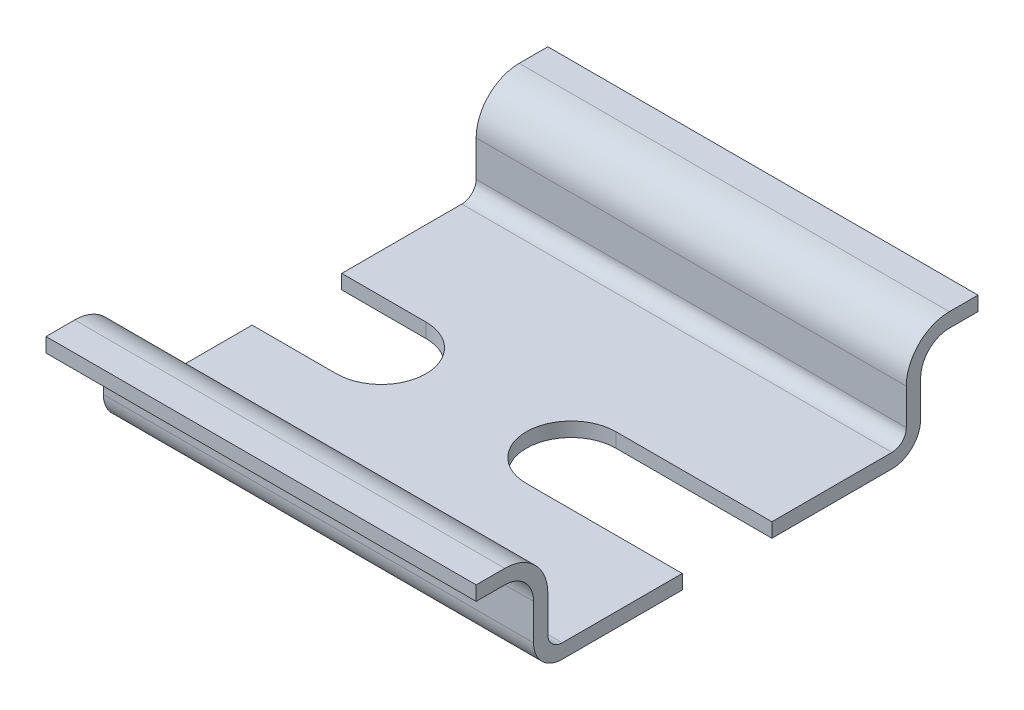
ISO-10303-21;
HEADER;
FILE_DESCRIPTION(('STEP AP214'),'2;1');
FILE_NAME('part.step','',(''),(''),'','','');
FILE_SCHEMA(('AUTOMOTIVE_DESIGN { 1 0 10303 214 1 1 1 1 }'));
ENDSEC;
DATA;
#1=APPLICATION_CONTEXT('core data for automotive mechanical design processes');
#2=APPLICATION_PROTOCOL_DEFINITION('international standard','automotive_design',2000,#1);
#3=PRODUCT_CONTEXT('',#1,'mechanical');
#4=PRODUCT('Part','Part','',(#3));
#5=PRODUCT_RELATED_PRODUCT_CATEGORY('part','',(#4));
#6=PRODUCT_DEFINITION_FORMATION('','',#4);
#7=PRODUCT_DEFINITION_CONTEXT('part definition',#1,'design');
#8=PRODUCT_DEFINITION('design','',#6,#7);
#9=PRODUCT_DEFINITION_SHAPE('','',#8);
#10=(LENGTH_UNIT() NAMED_UNIT(*) SI_UNIT(.MILLI.,.METRE.));
#11=(NAMED_UNIT(*) PLANE_ANGLE_UNIT() SI_UNIT($,.RADIAN.));
#12=(NAMED_UNIT(*) SI_UNIT($,.STERADIAN.) SOLID_ANGLE_UNIT());
#13=UNCERTAINTY_MEASURE_WITH_UNIT(LENGTH_MEASURE(1.E-05),#10,'distance_accuracy_value','');
#14=(GEOMETRIC_REPRESENTATION_CONTEXT(3) GLOBAL_UNCERTAINTY_ASSIGNED_CONTEXT((#13)) GLOBAL_UNIT_ASSIGNED_CONTEXT((#10,
#11,#12)) REPRESENTATION_CONTEXT('',''));
#15=CARTESIAN_POINT('',(0.,0.,0.));
#16=DIRECTION('',(0.,0.,1.));
#17=DIRECTION('',(1.,0.,0.));
#18=AXIS2_PLACEMENT_3D('',#15,#16,#17);
#19=CARTESIAN_POINT('',(30.,4.5,15.5));
#20=DIRECTION('',(1.,0.,0.));
#21=DIRECTION('',(0.,0.,-1.));
#22=AXIS2_PLACEMENT_3D('',#19,#20,#21);
#23=PLANE('',#22);
#24=DIRECTION('',(0.,-1.,0.));
#25=VECTOR('',#24,1.);
#26=CARTESIAN_POINT('',(30.,7.501,-3.125));
#27=LINE('',#26,#25);
#28=CARTESIAN_POINT('',(30.,1.,-3.125));
#29=VERTEX_POINT('',#28);
#30=CARTESIAN_POINT('',(30.,0.,-3.125));
#31=VERTEX_POINT('',#30);
#32=EDGE_CURVE('E233',#29,#31,#27,.T.);
#33=ORIENTED_EDGE('',*,*,#32,.T.);
#34=DIRECTION('',(0.,0.,1.));
#35=VECTOR('',#34,1.);
#36=CARTESIAN_POINT('',(30.,0.,11.5));
#37=LINE('',#36,#35);
#38=CARTESIAN_POINT('',(30.,0.,-11.5));
#39=VERTEX_POINT('',#38);
#40=EDGE_CURVE('E248',#39,#31,#37,.T.);
#41=ORIENTED_EDGE('',*,*,#40,.F.);
#42=CARTESIAN_POINT('',(30.,2.,-11.5));
#43=DIRECTION('',(-1.,0.,0.));
#44=DIRECTION('',(0.,0.,1.));
#45=AXIS2_PLACEMENT_3D('',#42,#43,#44);
#46=CIRCLE('',#45,2.);
#47=CARTESIAN_POINT('',(30.,2.,-13.5));
#48=VERTEX_POINT('',#47);
#49=EDGE_CURVE('E260',#48,#39,#46,.T.);
#50=ORIENTED_EDGE('',*,*,#49,.F.);
#51=DIRECTION('',(0.,-1.,0.));
#52=VECTOR('',#51,1.);
#53=CARTESIAN_POINT('',(30.,2.,-13.5));
#54=LINE('',#53,#52);
#55=CARTESIAN_POINT('',(30.,4.5,-13.5));
#56=VERTEX_POINT('',#55);
#57=EDGE_CURVE('E265',#56,#48,#54,.T.);
#58=ORIENTED_EDGE('',*,*,#57,.F.);
#59=CARTESIAN_POINT('',(30.,4.5,-15.5));
#60=DIRECTION('',(1.,0.,0.));
#61=DIRECTION('',(0.,0.,-1.));
#62=AXIS2_PLACEMENT_3D('',#59,#60,#61);
#63=CIRCLE('',#62,2.);
#64=CARTESIAN_POINT('',(30.,6.5,-15.5));
#65=VERTEX_POINT('',#64);
#66=EDGE_CURVE('E274',#65,#56,#63,.T.);
#67=ORIENTED_EDGE('',*,*,#66,.F.);
#68=DIRECTION('',(0.,0.,1.));
#69=VECTOR('',#68,1.);
#70=CARTESIAN_POINT('',(30.,6.5,-15.5));
#71=LINE('',#70,#69);
#72=CARTESIAN_POINT('',(30.,6.5,-17.5));
#73=VERTEX_POINT('',#72);
#74=EDGE_CURVE('E278',#73,#65,#71,.T.);
#75=ORIENTED_EDGE('',*,*,#74,.F.);
#76=DIRECTION('',(0.,-1.,0.));
#77=VECTOR('',#76,1.);
#78=CARTESIAN_POINT('',(30.,7.5,-17.5));
#79=LINE('',#78,#77);
#80=CARTESIAN_POINT('',(30.,7.5,-17.5));
#81=VERTEX_POINT('',#80);
#82=EDGE_CURVE('E282',#81,#73,#79,.T.);
#83=ORIENTED_EDGE('',*,*,#82,.F.);
#84=DIRECTION('',(0.,0.,-1.));
#85=VECTOR('',#84,1.);
#86=CARTESIAN_POINT('',(30.,7.5,-15.5));
#87=LINE('',#86,#85);
#88=CARTESIAN_POINT('',(30.,7.5,-15.5));
#89=VERTEX_POINT('',#88);
#90=EDGE_CURVE('E286',#81,#89,#87,.F.);
#91=ORIENTED_EDGE('',*,*,#90,.T.);
#92=CARTESIAN_POINT('',(30.,4.5,-15.5));
#93=DIRECTION('',(1.,0.,0.));
#94=DIRECTION('',(0.,0.,-1.));
#95=AXIS2_PLACEMENT_3D('',#92,#93,#94);
#96=CIRCLE('',#95,3.);
#97=CARTESIAN_POINT('',(30.,4.5,-12.5));
#98=VERTEX_POINT('',#97);
#99=EDGE_CURVE('E289',#89,#98,#96,.T.);
#100=ORIENTED_EDGE('',*,*,#99,.T.);
#101=DIRECTION('',(0.,1.,0.));
#102=VECTOR('',#101,1.);
#103=CARTESIAN_POINT('',(30.,2.,-12.5));
#104=LINE('',#103,#102);
#105=CARTESIAN_POINT('',(30.,2.,-12.5));
#106=VERTEX_POINT('',#105);
#107=EDGE_CURVE('E292',#98,#106,#104,.F.);
#108=ORIENTED_EDGE('',*,*,#107,.T.);
#109=CARTESIAN_POINT('',(30.,2.,-11.5));
#110=DIRECTION('',(1.,0.,0.));
#111=DIRECTION('',(0.,0.,-1.));
#112=AXIS2_PLACEMENT_3D('',#109,#110,#111);
#113=CIRCLE('',#112,0.999999999999999);
#114=CARTESIAN_POINT('',(30.,1.,-11.5));
#115=VERTEX_POINT('',#114);
#116=EDGE_CURVE('E295',#106,#115,#113,.F.);
#117=ORIENTED_EDGE('',*,*,#116,.T.);
#118=DIRECTION('',(0.,0.,-1.));
#119=VECTOR('',#118,1.);
#120=CARTESIAN_POINT('',(30.,1.,11.5));
#121=LINE('',#120,#119);
#122=EDGE_CURVE('E251',#115,#29,#121,.F.);
#123=ORIENTED_EDGE('',*,*,#122,.T.);
#124=EDGE_LOOP('',(#33,#41,#50,#58,#67,#75,#83,#91,#100,#108,#117,#123));
#125=FACE_BOUND('',#124,.T.);
#126=ADVANCED_FACE('F45',(#125),#23,.T.);
#127=CARTESIAN_POINT('',(0.,4.5,15.5));
#128=DIRECTION('',(1.,0.,0.));
#129=DIRECTION('',(0.,0.,-1.));
#130=AXIS2_PLACEMENT_3D('',#127,#128,#129);
#131=PLANE('',#130);
#132=DIRECTION('',(0.,0.,1.));
#133=VECTOR('',#132,1.);
#134=CARTESIAN_POINT('',(0.,0.,11.5));
#135=LINE('',#134,#133);
#136=CARTESIAN_POINT('',(0.,0.,-11.5));
#137=VERTEX_POINT('',#136);
#138=CARTESIAN_POINT('',(0.,0.,-3.125));
#139=VERTEX_POINT('',#138);
#140=EDGE_CURVE('E337',#137,#139,#135,.T.);
#141=ORIENTED_EDGE('',*,*,#140,.T.);
#142=DIRECTION('',(0.,-1.,0.));
#143=VECTOR('',#142,1.);
#144=CARTESIAN_POINT('',(0.,7.501,-3.125));
#145=LINE('',#144,#143);
#146=CARTESIAN_POINT('',(0.,1.,-3.125));
#147=VERTEX_POINT('',#146);
#148=EDGE_CURVE('E518',#147,#139,#145,.T.);
#149=ORIENTED_EDGE('',*,*,#148,.F.);
#150=DIRECTION('',(0.,0.,-1.));
#151=VECTOR('',#150,1.);
#152=CARTESIAN_POINT('',(0.,1.,11.5));
#153=LINE('',#152,#151);
#154=CARTESIAN_POINT('',(0.,1.,-11.5));
#155=VERTEX_POINT('',#154);
#156=EDGE_CURVE('E374',#155,#147,#153,.F.);
#157=ORIENTED_EDGE('',*,*,#156,.F.);
#158=CARTESIAN_POINT('',(0.,2.,-11.5));
#159=DIRECTION('',(1.,0.,0.));
#160=DIRECTION('',(0.,0.,-1.));
#161=AXIS2_PLACEMENT_3D('',#158,#159,#160);
#162=CIRCLE('',#161,0.999999999999999);
#163=CARTESIAN_POINT('',(0.,2.,-12.5));
#164=VERTEX_POINT('',#163);
#165=EDGE_CURVE('E370',#164,#155,#162,.F.);
#166=ORIENTED_EDGE('',*,*,#165,.F.);
#167=DIRECTION('',(0.,1.,0.));
#168=VECTOR('',#167,1.);
#169=CARTESIAN_POINT('',(0.,2.,-12.5));
#170=LINE('',#169,#168);
#171=CARTESIAN_POINT('',(0.,4.5,-12.5));
#172=VERTEX_POINT('',#171);
#173=EDGE_CURVE('E367',#172,#164,#170,.F.);
#174=ORIENTED_EDGE('',*,*,#173,.F.);
#175=CARTESIAN_POINT('',(0.,4.5,-15.5));
#176=DIRECTION('',(1.,0.,0.));
#177=DIRECTION('',(0.,0.,-1.));
#178=AXIS2_PLACEMENT_3D('',#175,#176,#177);
#179=CIRCLE('',#178,3.);
#180=CARTESIAN_POINT('',(0.,7.5,-15.5));
#181=VERTEX_POINT('',#180);
#182=EDGE_CURVE('E364',#181,#172,#179,.T.);
#183=ORIENTED_EDGE('',*,*,#182,.F.);
#184=DIRECTION('',(0.,0.,-1.));
#185=VECTOR('',#184,1.);
#186=CARTESIAN_POINT('',(0.,7.5,-15.5));
#187=LINE('',#186,#185);
#188=CARTESIAN_POINT('',(0.,7.5,-17.5));
#189=VERTEX_POINT('',#188);
#190=EDGE_CURVE('E361',#189,#181,#187,.F.);
#191=ORIENTED_EDGE('',*,*,#190,.F.);
#192=DIRECTION('',(0.,-1.,0.));
#193=VECTOR('',#192,1.);
#194=CARTESIAN_POINT('',(0.,7.5,-17.5));
#195=LINE('',#194,#193);
#196=CARTESIAN_POINT('',(0.,6.5,-17.5));
#197=VERTEX_POINT('',#196);
#198=EDGE_CURVE('E357',#189,#197,#195,.T.);
#199=ORIENTED_EDGE('',*,*,#198,.T.);
#200=DIRECTION('',(0.,0.,1.));
#201=VECTOR('',#200,1.);
#202=CARTESIAN_POINT('',(0.,6.5,-15.5));
#203=LINE('',#202,#201);
#204=CARTESIAN_POINT('',(0.,6.5,-15.5));
#205=VERTEX_POINT('',#204);
#206=EDGE_CURVE('E353',#197,#205,#203,.T.);
#207=ORIENTED_EDGE('',*,*,#206,.T.);
#208=CARTESIAN_POINT('',(0.,4.5,-15.5));
#209=DIRECTION('',(1.,0.,0.));
#210=DIRECTION('',(0.,0.,-1.));
#211=AXIS2_PLACEMENT_3D('',#208,#209,#210);
#212=CIRCLE('',#211,2.);
#213=CARTESIAN_POINT('',(0.,4.5,-13.5));
#214=VERTEX_POINT('',#213);
#215=EDGE_CURVE('E349',#205,#214,#212,.T.);
#216=ORIENTED_EDGE('',*,*,#215,.T.);
#217=DIRECTION('',(0.,-1.,0.));
#218=VECTOR('',#217,1.);
#219=CARTESIAN_POINT('',(0.,2.,-13.5));
#220=LINE('',#219,#218);
#221=CARTESIAN_POINT('',(0.,2.,-13.5));
#222=VERTEX_POINT('',#221);
#223=EDGE_CURVE('E345',#214,#222,#220,.T.);
#224=ORIENTED_EDGE('',*,*,#223,.T.);
#225=CARTESIAN_POINT('',(0.,2.,-11.5));
#226=DIRECTION('',(-1.,0.,0.));
#227=DIRECTION('',(0.,0.,1.));
#228=AXIS2_PLACEMENT_3D('',#225,#226,#227);
#229=CIRCLE('',#228,2.);
#230=EDGE_CURVE('E341',#222,#137,#229,.T.);
#231=ORIENTED_EDGE('',*,*,#230,.T.);
#232=EDGE_LOOP('',(#141,#149,#157,#166,#174,#183,#191,#199,#207,#216,#224,#231));
#233=FACE_BOUND('',#232,.T.);
#234=ADVANCED_FACE('F580',(#233),#131,.F.);
#235=CARTESIAN_POINT('',(30.,7.5,15.5));
#236=DIRECTION('',(0.,-1.,0.));
#237=DIRECTION('',(0.,0.,-1.));
#238=AXIS2_PLACEMENT_3D('',#235,#236,#237);
#239=PLANE('',#238);
#240=DIRECTION('',(0.,0.,-1.));
#241=VECTOR('',#240,1.);
#242=CARTESIAN_POINT('',(0.,7.5,15.5));
#243=LINE('',#242,#241);
#244=CARTESIAN_POINT('',(0.,7.5,15.5));
#245=VERTEX_POINT('',#244);
#246=CARTESIAN_POINT('',(0.,7.5,17.5));
#247=VERTEX_POINT('',#246);
#248=EDGE_CURVE('E311',#245,#247,#243,.F.);
#249=ORIENTED_EDGE('',*,*,#248,.T.);
#250=DIRECTION('',(-1.,0.,0.));
#251=VECTOR('',#250,1.);
#252=CARTESIAN_POINT('',(30.,7.5,17.5));
#253=LINE('',#252,#251);
#254=CARTESIAN_POINT('',(30.,7.5,17.5));
#255=VERTEX_POINT('',#254);
#256=EDGE_CURVE('E11',#255,#247,#253,.T.);
#257=ORIENTED_EDGE('',*,*,#256,.F.);
#258=DIRECTION('',(0.,0.,-1.));
#259=VECTOR('',#258,1.);
#260=CARTESIAN_POINT('',(30.,7.5,15.5));
#261=LINE('',#260,#259);
#262=CARTESIAN_POINT('',(30.,7.5,15.5));
#263=VERTEX_POINT('',#262);
#264=EDGE_CURVE('E387',#263,#255,#261,.F.);
#265=ORIENTED_EDGE('',*,*,#264,.F.);
#266=DIRECTION('',(-1.,0.,0.));
#267=VECTOR('',#266,1.);
#268=CARTESIAN_POINT('',(30.,7.5,15.5));
#269=LINE('',#268,#267);
#270=EDGE_CURVE('E310',#263,#245,#269,.T.);
#271=ORIENTED_EDGE('',*,*,#270,.T.);
#272=EDGE_LOOP('',(#249,#257,#265,#271));
#273=FACE_BOUND('',#272,.T.);
#274=ADVANCED_FACE('F47',(#273),#239,.F.);
#275=CARTESIAN_POINT('',(30.,6.5,17.5));
#276=DIRECTION('',(0.,0.,1.));
#277=DIRECTION('',(1.,0.,0.));
#278=AXIS2_PLACEMENT_3D('',#275,#276,#277);
#279=PLANE('',#278);
#280=DIRECTION('',(0.,1.,0.));
#281=VECTOR('',#280,1.);
#282=CARTESIAN_POINT('',(0.,6.5,17.5));
#283=LINE('',#282,#281);
#284=CARTESIAN_POINT('',(0.,6.5,17.5));
#285=VERTEX_POINT('',#284);
#286=EDGE_CURVE('E315',#285,#247,#283,.T.);
#287=ORIENTED_EDGE('',*,*,#286,.F.);
#288=DIRECTION('',(-1.,0.,0.));
#289=VECTOR('',#288,1.);
#290=CARTESIAN_POINT('',(30.,6.5,17.5));
#291=LINE('',#290,#289);
#292=CARTESIAN_POINT('',(30.,6.5,17.5));
#293=VERTEX_POINT('',#292);
#294=EDGE_CURVE('E54',#293,#285,#291,.T.);
#295=ORIENTED_EDGE('',*,*,#294,.F.);
#296=DIRECTION('',(0.,1.,0.));
#297=VECTOR('',#296,1.);
#298=CARTESIAN_POINT('',(30.,6.5,17.5));
#299=LINE('',#298,#297);
#300=EDGE_CURVE('E476',#293,#255,#299,.T.);
#301=ORIENTED_EDGE('',*,*,#300,.T.);
#302=ORIENTED_EDGE('',*,*,#256,.T.);
#303=EDGE_LOOP('',(#287,#295,#301,#302));
#304=FACE_BOUND('',#303,.T.);
#305=ADVANCED_FACE('F459',(#304),#279,.T.);
#306=CARTESIAN_POINT('',(30.,6.5,15.5));
#307=DIRECTION('',(0.,-1.,0.));
#308=DIRECTION('',(0.,0.,-1.));
#309=AXIS2_PLACEMENT_3D('',#306,#307,#308);
#310=PLANE('',#309);
#311=DIRECTION('',(0.,0.,1.));
#312=VECTOR('',#311,1.);
#313=CARTESIAN_POINT('',(0.,6.5,15.5));
#314=LINE('',#313,#312);
#315=CARTESIAN_POINT('',(0.,6.5,15.5));
#316=VERTEX_POINT('',#315);
#317=EDGE_CURVE('E320',#316,#285,#314,.T.);
#318=ORIENTED_EDGE('',*,*,#317,.F.);
#319=DIRECTION('',(-1.,0.,0.));
#320=VECTOR('',#319,1.);
#321=CARTESIAN_POINT('',(30.,6.5,15.5));
#322=LINE('',#321,#320);
#323=CARTESIAN_POINT('',(30.,6.5,15.5));
#324=VERTEX_POINT('',#323);
#325=EDGE_CURVE('E446',#324,#316,#322,.T.);
#326=ORIENTED_EDGE('',*,*,#325,.F.);
#327=DIRECTION('',(0.,0.,1.));
#328=VECTOR('',#327,1.);
#329=CARTESIAN_POINT('',(30.,6.5,15.5));
#330=LINE('',#329,#328);
#331=EDGE_CURVE('E455',#324,#293,#330,.T.);
#332=ORIENTED_EDGE('',*,*,#331,.T.);
#333=ORIENTED_EDGE('',*,*,#294,.T.);
#334=EDGE_LOOP('',(#318,#326,#332,#333));
#335=FACE_BOUND('',#334,.T.);
#336=ADVANCED_FACE('F453',(#335),#310,.T.);
#337=CARTESIAN_POINT('',(30.,4.5,15.5));
#338=DIRECTION('',(-1.,0.,0.));
#339=DIRECTION('',(0.,0.,1.));
#340=AXIS2_PLACEMENT_3D('',#337,#338,#339);
#341=CYLINDRICAL_SURFACE('',#340,2.);
#342=CARTESIAN_POINT('',(0.,4.5,15.5));
#343=DIRECTION('',(1.,0.,0.));
#344=DIRECTION('',(0.,0.,1.));
#345=AXIS2_PLACEMENT_3D('',#342,#343,#344);
#346=CIRCLE('',#345,2.);
#347=CARTESIAN_POINT('',(0.,4.5,13.5));
#348=VERTEX_POINT('',#347);
#349=EDGE_CURVE('E324',#348,#316,#346,.T.);
#350=ORIENTED_EDGE('',*,*,#349,.F.);
#351=DIRECTION('',(-1.,0.,0.));
#352=VECTOR('',#351,1.);
#353=CARTESIAN_POINT('',(30.,4.5,13.5));
#354=LINE('',#353,#352);
#355=CARTESIAN_POINT('',(30.,4.5,13.5));
#356=VERTEX_POINT('',#355);
#357=EDGE_CURVE('E443',#356,#348,#354,.T.);
#358=ORIENTED_EDGE('',*,*,#357,.F.);
#359=CARTESIAN_POINT('',(30.,4.5,15.5));
#360=DIRECTION('',(1.,0.,0.));
#361=DIRECTION('',(0.,0.,1.));
#362=AXIS2_PLACEMENT_3D('',#359,#360,#361);
#363=CIRCLE('',#362,2.);
#364=EDGE_CURVE('E471',#356,#324,#363,.T.);
#365=ORIENTED_EDGE('',*,*,#364,.T.);
#366=ORIENTED_EDGE('',*,*,#325,.T.);
#367=EDGE_LOOP('',(#350,#358,#365,#366));
#368=FACE_BOUND('',#367,.T.);
#369=ADVANCED_FACE('F468',(#368),#341,.F.);
#370=CARTESIAN_POINT('',(30.,2.,13.5));
#371=DIRECTION('',(0.,0.,1.));
#372=DIRECTION('',(1.,0.,0.));
#373=AXIS2_PLACEMENT_3D('',#370,#371,#372);
#374=PLANE('',#373);
#375=DIRECTION('',(0.,1.,0.));
#376=VECTOR('',#375,1.);
#377=CARTESIAN_POINT('',(0.,2.,13.5));
#378=LINE('',#377,#376);
#379=CARTESIAN_POINT('',(0.,2.,13.5));
#380=VERTEX_POINT('',#379);
#381=EDGE_CURVE('E328',#380,#348,#378,.T.);
#382=ORIENTED_EDGE('',*,*,#381,.F.);
#383=DIRECTION('',(-1.,0.,0.));
#384=VECTOR('',#383,1.);
#385=CARTESIAN_POINT('',(30.,2.,13.5));
#386=LINE('',#385,#384);
#387=CARTESIAN_POINT('',(30.,2.,13.5));
#388=VERTEX_POINT('',#387);
#389=EDGE_CURVE('E440',#388,#380,#386,.T.);
#390=ORIENTED_EDGE('',*,*,#389,.F.);
#391=DIRECTION('',(0.,1.,0.));
#392=VECTOR('',#391,1.);
#393=CARTESIAN_POINT('',(30.,2.,13.5));
#394=LINE('',#393,#392);
#395=EDGE_CURVE('E481',#388,#356,#394,.T.);
#396=ORIENTED_EDGE('',*,*,#395,.T.);
#397=ORIENTED_EDGE('',*,*,#357,.T.);
#398=EDGE_LOOP('',(#382,#390,#396,#397));
#399=FACE_BOUND('',#398,.T.);
#400=ADVANCED_FACE('F824',(#399),#374,.T.);
#401=CARTESIAN_POINT('',(30.,2.,11.5));
#402=DIRECTION('',(-1.,0.,0.));
#403=DIRECTION('',(0.,0.,1.));
#404=AXIS2_PLACEMENT_3D('',#401,#402,#403);
#405=CYLINDRICAL_SURFACE('',#404,2.);
#406=CARTESIAN_POINT('',(0.,2.,11.5));
#407=DIRECTION('',(-1.,0.,0.));
#408=DIRECTION('',(0.,0.,-1.));
#409=AXIS2_PLACEMENT_3D('',#406,#407,#408);
#410=CIRCLE('',#409,2.);
#411=CARTESIAN_POINT('',(0.,0.,11.5));
#412=VERTEX_POINT('',#411);
#413=EDGE_CURVE('E332',#412,#380,#410,.T.);
#414=ORIENTED_EDGE('',*,*,#413,.F.);
#415=DIRECTION('',(-1.,0.,0.));
#416=VECTOR('',#415,1.);
#417=CARTESIAN_POINT('',(30.,0.,11.5));
#418=LINE('',#417,#416);
#419=CARTESIAN_POINT('',(30.,0.,11.5));
#420=VERTEX_POINT('',#419);
#421=EDGE_CURVE('E436',#420,#412,#418,.T.);
#422=ORIENTED_EDGE('',*,*,#421,.F.);
#423=CARTESIAN_POINT('',(30.,2.,11.5));
#424=DIRECTION('',(-1.,0.,0.));
#425=DIRECTION('',(0.,0.,-1.));
#426=AXIS2_PLACEMENT_3D('',#423,#424,#425);
#427=CIRCLE('',#426,2.);
#428=EDGE_CURVE('E267',#420,#388,#427,.T.);
#429=ORIENTED_EDGE('',*,*,#428,.T.);
#430=ORIENTED_EDGE('',*,*,#389,.T.);
#431=EDGE_LOOP('',(#414,#422,#429,#430));
#432=FACE_BOUND('',#431,.T.);
#433=ADVANCED_FACE('F493',(#432),#405,.T.);
#434=CARTESIAN_POINT('',(30.,0.,11.5));
#435=DIRECTION('',(0.,-1.,0.));
#436=DIRECTION('',(0.,0.,-1.));
#437=AXIS2_PLACEMENT_3D('',#434,#435,#436);
#438=PLANE('',#437);
#439=DIRECTION('',(1.,0.,0.));
#440=VECTOR('',#439,1.);
#441=CARTESIAN_POINT('',(19.125,0.,-3.125));
#442=LINE('',#441,#440);
#443=CARTESIAN_POINT('',(19.125,0.,-3.125));
#444=VERTEX_POINT('',#443);
#445=EDGE_CURVE('E229',#444,#31,#442,.T.);
#446=ORIENTED_EDGE('',*,*,#445,.F.);
#447=CARTESIAN_POINT('',(19.125,0.,0.));
#448=DIRECTION('',(0.,-1.,0.));
#449=DIRECTION('',(0.,0.,-1.));
#450=AXIS2_PLACEMENT_3D('',#447,#448,#449);
#451=CIRCLE('',#450,3.125);
#452=CARTESIAN_POINT('',(19.125,0.,3.125));
#453=VERTEX_POINT('',#452);
#454=EDGE_CURVE('E242',#453,#444,#451,.T.);
#455=ORIENTED_EDGE('',*,*,#454,.F.);
#456=DIRECTION('',(-1.,0.,0.));
#457=VECTOR('',#456,1.);
#458=CARTESIAN_POINT('',(19.125,0.,3.125));
#459=LINE('',#458,#457);
#460=CARTESIAN_POINT('',(30.,0.,3.125));
#461=VERTEX_POINT('',#460);
#462=EDGE_CURVE('E499',#461,#453,#459,.T.);
#463=ORIENTED_EDGE('',*,*,#462,.F.);
#464=EDGE_CURVE('E261',#461,#420,#37,.T.);
#465=ORIENTED_EDGE('',*,*,#464,.T.);
#466=ORIENTED_EDGE('',*,*,#421,.T.);
#467=CARTESIAN_POINT('',(0.,0.,3.125));
#468=VERTEX_POINT('',#467);
#469=EDGE_CURVE('E336',#468,#412,#135,.T.);
#470=ORIENTED_EDGE('',*,*,#469,.F.);
#471=DIRECTION('',(-1.,0.,0.));
#472=VECTOR('',#471,1.);
#473=CARTESIAN_POINT('',(-5.875,0.,3.125));
#474=LINE('',#473,#472);
#475=CARTESIAN_POINT('',(5.875,0.,3.125));
#476=VERTEX_POINT('',#475);
#477=EDGE_CURVE('E69',#476,#468,#474,.T.);
#478=ORIENTED_EDGE('',*,*,#477,.F.);
#479=CARTESIAN_POINT('',(5.875,0.,0.));
#480=DIRECTION('',(0.,-1.,0.));
#481=DIRECTION('',(0.,0.,1.));
#482=AXIS2_PLACEMENT_3D('',#479,#480,#481);
#483=CIRCLE('',#482,3.125);
#484=CARTESIAN_POINT('',(5.875,0.,-3.125));
#485=VERTEX_POINT('',#484);
#486=EDGE_CURVE('E527',#485,#476,#483,.T.);
#487=ORIENTED_EDGE('',*,*,#486,.F.);
#488=DIRECTION('',(1.,0.,0.));
#489=VECTOR('',#488,1.);
#490=CARTESIAN_POINT('',(-5.875,0.,-3.125));
#491=LINE('',#490,#489);
#492=EDGE_CURVE('E533',#139,#485,#491,.T.);
#493=ORIENTED_EDGE('',*,*,#492,.F.);
#494=ORIENTED_EDGE('',*,*,#140,.F.);
#495=DIRECTION('',(-1.,0.,0.));
#496=VECTOR('',#495,1.);
#497=CARTESIAN_POINT('',(30.,0.,-11.5));
#498=LINE('',#497,#496);
#499=EDGE_CURVE('E258',#39,#137,#498,.T.);
#500=ORIENTED_EDGE('',*,*,#499,.F.);
#501=ORIENTED_EDGE('',*,*,#40,.T.);
#502=EDGE_LOOP('',(#446,#455,#463,#465,#466,#470,#478,#487,#493,#494,#500,#501));
#503=FACE_BOUND('',#502,.T.);
#504=ADVANCED_FACE('F256',(#503),#438,.T.);
#505=CARTESIAN_POINT('',(30.,2.,-11.5));
#506=DIRECTION('',(-1.,0.,0.));
#507=DIRECTION('',(0.,0.,1.));
#508=AXIS2_PLACEMENT_3D('',#505,#506,#507);
#509=CYLINDRICAL_SURFACE('',#508,2.);
#510=ORIENTED_EDGE('',*,*,#230,.F.);
#511=DIRECTION('',(-1.,0.,0.));
#512=VECTOR('',#511,1.);
#513=CARTESIAN_POINT('',(30.,2.,-13.5));
#514=LINE('',#513,#512);
#515=EDGE_CURVE('E431',#48,#222,#514,.T.);
#516=ORIENTED_EDGE('',*,*,#515,.F.);
#517=ORIENTED_EDGE('',*,*,#49,.T.);
#518=ORIENTED_EDGE('',*,*,#499,.T.);
#519=EDGE_LOOP('',(#510,#516,#517,#518));
#520=FACE_BOUND('',#519,.T.);
#521=ADVANCED_FACE('F621',(#520),#509,.T.);
#522=CARTESIAN_POINT('',(30.,2.,-13.5));
#523=DIRECTION('',(0.,0.,-1.));
#524=DIRECTION('',(-1.,0.,0.));
#525=AXIS2_PLACEMENT_3D('',#522,#523,#524);
#526=PLANE('',#525);
#527=ORIENTED_EDGE('',*,*,#223,.F.);
#528=DIRECTION('',(-1.,0.,0.));
#529=VECTOR('',#528,1.);
#530=CARTESIAN_POINT('',(30.,4.5,-13.5));
#531=LINE('',#530,#529);
#532=EDGE_CURVE('E428',#56,#214,#531,.T.);
#533=ORIENTED_EDGE('',*,*,#532,.F.);
#534=ORIENTED_EDGE('',*,*,#57,.T.);
#535=ORIENTED_EDGE('',*,*,#515,.T.);
#536=EDGE_LOOP('',(#527,#533,#534,#535));
#537=FACE_BOUND('',#536,.T.);
#538=ADVANCED_FACE('F618',(#537),#526,.T.);
#539=CARTESIAN_POINT('',(30.,4.5,-15.5));
#540=DIRECTION('',(-1.,0.,0.));
#541=DIRECTION('',(0.,0.,1.));
#542=AXIS2_PLACEMENT_3D('',#539,#540,#541);
#543=CYLINDRICAL_SURFACE('',#542,2.);
#544=ORIENTED_EDGE('',*,*,#215,.F.);
#545=DIRECTION('',(-1.,0.,0.));
#546=VECTOR('',#545,1.);
#547=CARTESIAN_POINT('',(30.,6.5,-15.5));
#548=LINE('',#547,#546);
#549=EDGE_CURVE('E425',#65,#205,#548,.T.);
#550=ORIENTED_EDGE('',*,*,#549,.F.);
#551=ORIENTED_EDGE('',*,*,#66,.T.);
#552=ORIENTED_EDGE('',*,*,#532,.T.);
#553=EDGE_LOOP('',(#544,#550,#551,#552));
#554=FACE_BOUND('',#553,.T.);
#555=ADVANCED_FACE('F614',(#554),#543,.F.);
#556=CARTESIAN_POINT('',(30.,6.5,-15.5));
#557=DIRECTION('',(0.,-1.,0.));
#558=DIRECTION('',(0.,0.,-1.));
#559=AXIS2_PLACEMENT_3D('',#556,#557,#558);
#560=PLANE('',#559);
#561=ORIENTED_EDGE('',*,*,#206,.F.);
#562=DIRECTION('',(-1.,0.,0.));
#563=VECTOR('',#562,1.);
#564=CARTESIAN_POINT('',(30.,6.5,-17.5));
#565=LINE('',#564,#563);
#566=EDGE_CURVE('E422',#73,#197,#565,.T.);
#567=ORIENTED_EDGE('',*,*,#566,.F.);
#568=ORIENTED_EDGE('',*,*,#74,.T.);
#569=ORIENTED_EDGE('',*,*,#549,.T.);
#570=EDGE_LOOP('',(#561,#567,#568,#569));
#571=FACE_BOUND('',#570,.T.);
#572=ADVANCED_FACE('F610',(#571),#560,.T.);
#573=CARTESIAN_POINT('',(30.,7.5,-17.5));
#574=DIRECTION('',(0.,0.,-1.));
#575=DIRECTION('',(-1.,0.,0.));
#576=AXIS2_PLACEMENT_3D('',#573,#574,#575);
#577=PLANE('',#576);
#578=ORIENTED_EDGE('',*,*,#198,.F.);
#579=DIRECTION('',(-1.,0.,0.));
#580=VECTOR('',#579,1.);
#581=CARTESIAN_POINT('',(30.,7.5,-17.5));
#582=LINE('',#581,#580);
#583=EDGE_CURVE('E419',#81,#189,#582,.T.);
#584=ORIENTED_EDGE('',*,*,#583,.F.);
#585=ORIENTED_EDGE('',*,*,#82,.T.);
#586=ORIENTED_EDGE('',*,*,#566,.T.);
#587=EDGE_LOOP('',(#578,#584,#585,#586));
#588=FACE_BOUND('',#587,.T.);
#589=ADVANCED_FACE('F606',(#588),#577,.T.);
#590=CARTESIAN_POINT('',(30.,7.5,-15.5));
#591=DIRECTION('',(0.,-1.,0.));
#592=DIRECTION('',(0.,0.,-1.));
#593=AXIS2_PLACEMENT_3D('',#590,#591,#592);
#594=PLANE('',#593);
#595=ORIENTED_EDGE('',*,*,#190,.T.);
#596=DIRECTION('',(-1.,0.,0.));
#597=VECTOR('',#596,1.);
#598=CARTESIAN_POINT('',(30.,7.5,-15.5));
#599=LINE('',#598,#597);
#600=EDGE_CURVE('E415',#89,#181,#599,.T.);
#601=ORIENTED_EDGE('',*,*,#600,.F.);
#602=ORIENTED_EDGE('',*,*,#90,.F.);
#603=ORIENTED_EDGE('',*,*,#583,.T.);
#604=EDGE_LOOP('',(#595,#601,#602,#603));
#605=FACE_BOUND('',#604,.T.);
#606=ADVANCED_FACE('F602',(#605),#594,.F.);
#607=CARTESIAN_POINT('',(30.,4.5,-15.5));
#608=DIRECTION('',(-1.,0.,0.));
#609=DIRECTION('',(0.,0.,1.));
#610=AXIS2_PLACEMENT_3D('',#607,#608,#609);
#611=CYLINDRICAL_SURFACE('',#610,3.);
#612=ORIENTED_EDGE('',*,*,#182,.T.);
#613=DIRECTION('',(-1.,0.,0.));
#614=VECTOR('',#613,1.);
#615=CARTESIAN_POINT('',(30.,4.5,-12.5));
#616=LINE('',#615,#614);
#617=EDGE_CURVE('E411',#98,#172,#616,.T.);
#618=ORIENTED_EDGE('',*,*,#617,.F.);
#619=ORIENTED_EDGE('',*,*,#99,.F.);
#620=ORIENTED_EDGE('',*,*,#600,.T.);
#621=EDGE_LOOP('',(#612,#618,#619,#620));
#622=FACE_BOUND('',#621,.T.);
#623=ADVANCED_FACE('F598',(#622),#611,.T.);
#624=CARTESIAN_POINT('',(30.,2.,-12.5));
#625=DIRECTION('',(0.,0.,-1.));
#626=DIRECTION('',(-1.,0.,0.));
#627=AXIS2_PLACEMENT_3D('',#624,#625,#626);
#628=PLANE('',#627);
#629=ORIENTED_EDGE('',*,*,#173,.T.);
#630=DIRECTION('',(-1.,0.,0.));
#631=VECTOR('',#630,1.);
#632=CARTESIAN_POINT('',(30.,2.,-12.5));
#633=LINE('',#632,#631);
#634=EDGE_CURVE('E407',#106,#164,#633,.T.);
#635=ORIENTED_EDGE('',*,*,#634,.F.);
#636=ORIENTED_EDGE('',*,*,#107,.F.);
#637=ORIENTED_EDGE('',*,*,#617,.T.);
#638=EDGE_LOOP('',(#629,#635,#636,#637));
#639=FACE_BOUND('',#638,.T.);
#640=ADVANCED_FACE('F593',(#639),#628,.F.);
#641=CARTESIAN_POINT('',(30.,2.,-11.5));
#642=DIRECTION('',(-1.,0.,0.));
#643=DIRECTION('',(0.,0.,1.));
#644=AXIS2_PLACEMENT_3D('',#641,#642,#643);
#645=CYLINDRICAL_SURFACE('',#644,0.999999999999999);
#646=ORIENTED_EDGE('',*,*,#165,.T.);
#647=DIRECTION('',(-1.,0.,0.));
#648=VECTOR('',#647,1.);
#649=CARTESIAN_POINT('',(30.,1.,-11.5));
#650=LINE('',#649,#648);
#651=EDGE_CURVE('E403',#115,#155,#650,.T.);
#652=ORIENTED_EDGE('',*,*,#651,.F.);
#653=ORIENTED_EDGE('',*,*,#116,.F.);
#654=ORIENTED_EDGE('',*,*,#634,.T.);
#655=EDGE_LOOP('',(#646,#652,#653,#654));
#656=FACE_BOUND('',#655,.T.);
#657=ADVANCED_FACE('F587',(#656),#645,.F.);
#658=CARTESIAN_POINT('',(30.,1.,11.5));
#659=DIRECTION('',(0.,-1.,0.));
#660=DIRECTION('',(0.,0.,-1.));
#661=AXIS2_PLACEMENT_3D('',#658,#659,#660);
#662=PLANE('',#661);
#663=CARTESIAN_POINT('',(19.125,0.999999999999999,0.));
#664=DIRECTION('',(0.,-1.,0.));
#665=DIRECTION('',(0.,0.,-1.));
#666=AXIS2_PLACEMENT_3D('',#663,#664,#665);
#667=CIRCLE('',#666,3.125);
#668=CARTESIAN_POINT('',(19.125,0.999999999999999,-3.125));
#669=VERTEX_POINT('',#668);
#670=CARTESIAN_POINT('',(19.125,0.999999999999999,3.125));
#671=VERTEX_POINT('',#670);
#672=EDGE_CURVE('E253',#669,#671,#667,.F.);
#673=ORIENTED_EDGE('',*,*,#672,.F.);
#674=DIRECTION('',(-1.,0.,0.));
#675=VECTOR('',#674,1.);
#676=CARTESIAN_POINT('',(19.125,0.999999999999999,-3.125));
#677=LINE('',#676,#675);
#678=EDGE_CURVE('E501',#29,#669,#677,.T.);
#679=ORIENTED_EDGE('',*,*,#678,.F.);
#680=ORIENTED_EDGE('',*,*,#122,.F.);
#681=ORIENTED_EDGE('',*,*,#651,.T.);
#682=ORIENTED_EDGE('',*,*,#156,.T.);
#683=DIRECTION('',(-1.,0.,0.));
#684=VECTOR('',#683,1.);
#685=CARTESIAN_POINT('',(-5.875,0.999999999999999,-3.125));
#686=LINE('',#685,#684);
#687=CARTESIAN_POINT('',(5.875,0.999999999999999,-3.125));
#688=VERTEX_POINT('',#687);
#689=EDGE_CURVE('E524',#688,#147,#686,.T.);
#690=ORIENTED_EDGE('',*,*,#689,.F.);
#691=CARTESIAN_POINT('',(5.875,0.999999999999999,0.));
#692=DIRECTION('',(0.,-1.,0.));
#693=DIRECTION('',(0.,0.,-1.));
#694=AXIS2_PLACEMENT_3D('',#691,#692,#693);
#695=CIRCLE('',#694,3.125);
#696=CARTESIAN_POINT('',(5.875,0.999999999999999,3.125));
#697=VERTEX_POINT('',#696);
#698=EDGE_CURVE('E521',#697,#688,#695,.F.);
#699=ORIENTED_EDGE('',*,*,#698,.F.);
#700=DIRECTION('',(1.,0.,0.));
#701=VECTOR('',#700,1.);
#702=CARTESIAN_POINT('',(-5.875,0.999999999999999,3.125));
#703=LINE('',#702,#701);
#704=CARTESIAN_POINT('',(0.,1.,3.125));
#705=VERTEX_POINT('',#704);
#706=EDGE_CURVE('E316',#705,#697,#703,.T.);
#707=ORIENTED_EDGE('',*,*,#706,.F.);
#708=CARTESIAN_POINT('',(0.,1.,11.5));
#709=VERTEX_POINT('',#708);
#710=EDGE_CURVE('E373',#705,#709,#153,.F.);
#711=ORIENTED_EDGE('',*,*,#710,.T.);
#712=DIRECTION('',(-1.,0.,0.));
#713=VECTOR('',#712,1.);
#714=CARTESIAN_POINT('',(30.,1.,11.5));
#715=LINE('',#714,#713);
#716=CARTESIAN_POINT('',(30.,1.,11.5));
#717=VERTEX_POINT('',#716);
#718=EDGE_CURVE('E399',#717,#709,#715,.T.);
#719=ORIENTED_EDGE('',*,*,#718,.F.);
#720=CARTESIAN_POINT('',(30.,1.,3.125));
#721=VERTEX_POINT('',#720);
#722=EDGE_CURVE('E298',#721,#717,#121,.F.);
#723=ORIENTED_EDGE('',*,*,#722,.F.);
#724=DIRECTION('',(1.,0.,0.));
#725=VECTOR('',#724,1.);
#726=CARTESIAN_POINT('',(19.125,0.999999999999999,3.125));
#727=LINE('',#726,#725);
#728=EDGE_CURVE('E61',#671,#721,#727,.T.);
#729=ORIENTED_EDGE('',*,*,#728,.F.);
#730=EDGE_LOOP('',(#673,#679,#680,#681,#682,#690,#699,#707,#711,#719,#723,#729));
#731=FACE_BOUND('',#730,.T.);
#732=ADVANCED_FACE('F583',(#731),#662,.F.);
#733=CARTESIAN_POINT('',(30.,2.,11.5));
#734=DIRECTION('',(-1.,0.,0.));
#735=DIRECTION('',(0.,0.,1.));
#736=AXIS2_PLACEMENT_3D('',#733,#734,#735);
#737=CYLINDRICAL_SURFACE('',#736,0.999999999999999);
#738=CARTESIAN_POINT('',(0.,2.,11.5));
#739=DIRECTION('',(1.,0.,0.));
#740=DIRECTION('',(0.,0.,-1.));
#741=AXIS2_PLACEMENT_3D('',#738,#739,#740);
#742=CIRCLE('',#741,0.999999999999999);
#743=CARTESIAN_POINT('',(0.,2.,12.5));
#744=VERTEX_POINT('',#743);
#745=EDGE_CURVE('E378',#709,#744,#742,.F.);
#746=ORIENTED_EDGE('',*,*,#745,.T.);
#747=DIRECTION('',(-1.,0.,0.));
#748=VECTOR('',#747,1.);
#749=CARTESIAN_POINT('',(30.,2.,12.5));
#750=LINE('',#749,#748);
#751=CARTESIAN_POINT('',(30.,2.,12.5));
#752=VERTEX_POINT('',#751);
#753=EDGE_CURVE('E395',#752,#744,#750,.T.);
#754=ORIENTED_EDGE('',*,*,#753,.F.);
#755=CARTESIAN_POINT('',(30.,2.,11.5));
#756=DIRECTION('',(1.,0.,0.));
#757=DIRECTION('',(0.,0.,-1.));
#758=AXIS2_PLACEMENT_3D('',#755,#756,#757);
#759=CIRCLE('',#758,0.999999999999999);
#760=EDGE_CURVE('E301',#717,#752,#759,.F.);
#761=ORIENTED_EDGE('',*,*,#760,.F.);
#762=ORIENTED_EDGE('',*,*,#718,.T.);
#763=EDGE_LOOP('',(#746,#754,#761,#762));
#764=FACE_BOUND('',#763,.T.);
#765=ADVANCED_FACE('F561',(#764),#737,.F.);
#766=CARTESIAN_POINT('',(30.,2.,12.5));
#767=DIRECTION('',(0.,0.,1.));
#768=DIRECTION('',(1.,0.,0.));
#769=AXIS2_PLACEMENT_3D('',#766,#767,#768);
#770=PLANE('',#769);
#771=DIRECTION('',(0.,1.,0.));
#772=VECTOR('',#771,1.);
#773=CARTESIAN_POINT('',(0.,2.,12.5));
#774=LINE('',#773,#772);
#775=CARTESIAN_POINT('',(0.,4.5,12.5));
#776=VERTEX_POINT('',#775);
#777=EDGE_CURVE('E381',#744,#776,#774,.T.);
#778=ORIENTED_EDGE('',*,*,#777,.T.);
#779=DIRECTION('',(-1.,0.,0.));
#780=VECTOR('',#779,1.);
#781=CARTESIAN_POINT('',(30.,4.5,12.5));
#782=LINE('',#781,#780);
#783=CARTESIAN_POINT('',(30.,4.5,12.5));
#784=VERTEX_POINT('',#783);
#785=EDGE_CURVE('E391',#784,#776,#782,.T.);
#786=ORIENTED_EDGE('',*,*,#785,.F.);
#787=DIRECTION('',(0.,1.,0.));
#788=VECTOR('',#787,1.);
#789=CARTESIAN_POINT('',(30.,2.,12.5));
#790=LINE('',#789,#788);
#791=EDGE_CURVE('E304',#752,#784,#790,.T.);
#792=ORIENTED_EDGE('',*,*,#791,.F.);
#793=ORIENTED_EDGE('',*,*,#753,.T.);
#794=EDGE_LOOP('',(#778,#786,#792,#793));
#795=FACE_BOUND('',#794,.T.);
#796=ADVANCED_FACE('F557',(#795),#770,.F.);
#797=CARTESIAN_POINT('',(30.,4.5,15.5));
#798=DIRECTION('',(-1.,0.,0.));
#799=DIRECTION('',(0.,0.,1.));
#800=AXIS2_PLACEMENT_3D('',#797,#798,#799);
#801=CYLINDRICAL_SURFACE('',#800,3.);
#802=CARTESIAN_POINT('',(0.,4.5,15.5));
#803=DIRECTION('',(1.,0.,0.));
#804=DIRECTION('',(0.,0.,-1.));
#805=AXIS2_PLACEMENT_3D('',#802,#803,#804);
#806=CIRCLE('',#805,3.);
#807=EDGE_CURVE('E384',#776,#245,#806,.T.);
#808=ORIENTED_EDGE('',*,*,#807,.T.);
#809=ORIENTED_EDGE('',*,*,#270,.F.);
#810=CARTESIAN_POINT('',(30.,4.5,15.5));
#811=DIRECTION('',(1.,0.,0.));
#812=DIRECTION('',(0.,0.,-1.));
#813=AXIS2_PLACEMENT_3D('',#810,#811,#812);
#814=CIRCLE('',#813,3.);
#815=EDGE_CURVE('E307',#784,#263,#814,.T.);
#816=ORIENTED_EDGE('',*,*,#815,.F.);
#817=ORIENTED_EDGE('',*,*,#785,.T.);
#818=EDGE_LOOP('',(#808,#809,#816,#817));
#819=FACE_BOUND('',#818,.T.);
#820=ADVANCED_FACE('F553',(#819),#801,.T.);
#821=DIRECTION('',(0.,1.,0.));
#822=VECTOR('',#821,1.);
#823=CARTESIAN_POINT('',(30.,7.501,3.125));
#824=LINE('',#823,#822);
#825=EDGE_CURVE('E254',#461,#721,#824,.T.);
#826=ORIENTED_EDGE('',*,*,#825,.T.);
#827=ORIENTED_EDGE('',*,*,#722,.T.);
#828=ORIENTED_EDGE('',*,*,#760,.T.);
#829=ORIENTED_EDGE('',*,*,#791,.T.);
#830=ORIENTED_EDGE('',*,*,#815,.T.);
#831=ORIENTED_EDGE('',*,*,#264,.T.);
#832=ORIENTED_EDGE('',*,*,#300,.F.);
#833=ORIENTED_EDGE('',*,*,#331,.F.);
#834=ORIENTED_EDGE('',*,*,#364,.F.);
#835=ORIENTED_EDGE('',*,*,#395,.F.);
#836=ORIENTED_EDGE('',*,*,#428,.F.);
#837=ORIENTED_EDGE('',*,*,#464,.F.);
#838=EDGE_LOOP('',(#826,#827,#828,#829,#830,#831,#832,#833,#834,#835,#836,#837));
#839=FACE_BOUND('',#838,.T.);
#840=ADVANCED_FACE('F473',(#839),#23,.T.);
#841=ORIENTED_EDGE('',*,*,#710,.F.);
#842=DIRECTION('',(0.,1.,0.));
#843=VECTOR('',#842,1.);
#844=CARTESIAN_POINT('',(0.,7.501,3.125));
#845=LINE('',#844,#843);
#846=EDGE_CURVE('E515',#468,#705,#845,.T.);
#847=ORIENTED_EDGE('',*,*,#846,.F.);
#848=ORIENTED_EDGE('',*,*,#469,.T.);
#849=ORIENTED_EDGE('',*,*,#413,.T.);
#850=ORIENTED_EDGE('',*,*,#381,.T.);
#851=ORIENTED_EDGE('',*,*,#349,.T.);
#852=ORIENTED_EDGE('',*,*,#317,.T.);
#853=ORIENTED_EDGE('',*,*,#286,.T.);
#854=ORIENTED_EDGE('',*,*,#248,.F.);
#855=ORIENTED_EDGE('',*,*,#807,.F.);
#856=ORIENTED_EDGE('',*,*,#777,.F.);
#857=ORIENTED_EDGE('',*,*,#745,.F.);
#858=EDGE_LOOP('',(#841,#847,#848,#849,#850,#851,#852,#853,#854,#855,#856,#857));
#859=FACE_BOUND('',#858,.T.);
#860=ADVANCED_FACE('F464',(#859),#131,.F.);
#861=CARTESIAN_POINT('',(5.875,7.501,0.));
#862=DIRECTION('',(0.,-1.,0.));
#863=DIRECTION('',(0.,0.,-1.));
#864=AXIS2_PLACEMENT_3D('',#861,#862,#863);
#865=CYLINDRICAL_SURFACE('',#864,3.125);
#866=ORIENTED_EDGE('',*,*,#698,.T.);
#867=DIRECTION('',(0.,-1.,0.));
#868=VECTOR('',#867,1.);
#869=CARTESIAN_POINT('',(5.875,7.501,-3.125));
#870=LINE('',#869,#868);
#871=EDGE_CURVE('E538',#688,#485,#870,.T.);
#872=ORIENTED_EDGE('',*,*,#871,.T.);
#873=ORIENTED_EDGE('',*,*,#486,.T.);
#874=DIRECTION('',(0.,-1.,0.));
#875=VECTOR('',#874,1.);
#876=CARTESIAN_POINT('',(5.875,7.501,3.125));
#877=LINE('',#876,#875);
#878=EDGE_CURVE('E537',#697,#476,#877,.T.);
#879=ORIENTED_EDGE('',*,*,#878,.F.);
#880=EDGE_LOOP('',(#866,#872,#873,#879));
#881=FACE_BOUND('',#880,.T.);
#882=ADVANCED_FACE('F571',(#881),#865,.F.);
#883=CARTESIAN_POINT('',(-5.875,7.501,-3.125));
#884=DIRECTION('',(0.,0.,-1.));
#885=DIRECTION('',(-1.,0.,0.));
#886=AXIS2_PLACEMENT_3D('',#883,#884,#885);
#887=PLANE('',#886);
#888=ORIENTED_EDGE('',*,*,#689,.T.);
#889=ORIENTED_EDGE('',*,*,#148,.T.);
#890=ORIENTED_EDGE('',*,*,#492,.T.);
#891=ORIENTED_EDGE('',*,*,#871,.F.);
#892=EDGE_LOOP('',(#888,#889,#890,#891));
#893=FACE_BOUND('',#892,.T.);
#894=ADVANCED_FACE('F576',(#893),#887,.F.);
#895=CARTESIAN_POINT('',(-5.875,7.501,3.125));
#896=DIRECTION('',(0.,0.,1.));
#897=DIRECTION('',(1.,0.,0.));
#898=AXIS2_PLACEMENT_3D('',#895,#896,#897);
#899=PLANE('',#898);
#900=ORIENTED_EDGE('',*,*,#706,.T.);
#901=ORIENTED_EDGE('',*,*,#878,.T.);
#902=ORIENTED_EDGE('',*,*,#477,.T.);
#903=ORIENTED_EDGE('',*,*,#846,.T.);
#904=EDGE_LOOP('',(#900,#901,#902,#903));
#905=FACE_BOUND('',#904,.T.);
#906=ADVANCED_FACE('F749',(#905),#899,.F.);
#907=CARTESIAN_POINT('',(19.125,7.501,-3.125));
#908=DIRECTION('',(0.,0.,-1.));
#909=DIRECTION('',(-1.,0.,0.));
#910=AXIS2_PLACEMENT_3D('',#907,#908,#909);
#911=PLANE('',#910);
#912=ORIENTED_EDGE('',*,*,#678,.T.);
#913=DIRECTION('',(0.,-1.,0.));
#914=VECTOR('',#913,1.);
#915=CARTESIAN_POINT('',(19.125,7.501,-3.125));
#916=LINE('',#915,#914);
#917=EDGE_CURVE('E235',#669,#444,#916,.T.);
#918=ORIENTED_EDGE('',*,*,#917,.T.);
#919=ORIENTED_EDGE('',*,*,#445,.T.);
#920=ORIENTED_EDGE('',*,*,#32,.F.);
#921=EDGE_LOOP('',(#912,#918,#919,#920));
#922=FACE_BOUND('',#921,.T.);
#923=ADVANCED_FACE('F232',(#922),#911,.F.);
#924=CARTESIAN_POINT('',(19.125,7.501,0.));
#925=DIRECTION('',(0.,-1.,0.));
#926=DIRECTION('',(0.,0.,-1.));
#927=AXIS2_PLACEMENT_3D('',#924,#925,#926);
#928=CYLINDRICAL_SURFACE('',#927,3.125);
#929=ORIENTED_EDGE('',*,*,#672,.T.);
#930=DIRECTION('',(0.,-1.,0.));
#931=VECTOR('',#930,1.);
#932=CARTESIAN_POINT('',(19.125,7.501,3.125));
#933=LINE('',#932,#931);
#934=EDGE_CURVE('E241',#671,#453,#933,.T.);
#935=ORIENTED_EDGE('',*,*,#934,.T.);
#936=ORIENTED_EDGE('',*,*,#454,.T.);
#937=ORIENTED_EDGE('',*,*,#917,.F.);
#938=EDGE_LOOP('',(#929,#935,#936,#937));
#939=FACE_BOUND('',#938,.T.);
#940=ADVANCED_FACE('F768',(#939),#928,.F.);
#941=CARTESIAN_POINT('',(19.125,7.501,3.125));
#942=DIRECTION('',(0.,0.,1.));
#943=DIRECTION('',(1.,0.,0.));
#944=AXIS2_PLACEMENT_3D('',#941,#942,#943);
#945=PLANE('',#944);
#946=ORIENTED_EDGE('',*,*,#728,.T.);
#947=ORIENTED_EDGE('',*,*,#825,.F.);
#948=ORIENTED_EDGE('',*,*,#462,.T.);
#949=ORIENTED_EDGE('',*,*,#934,.F.);
#950=EDGE_LOOP('',(#946,#947,#948,#949));
#951=FACE_BOUND('',#950,.T.);
#952=ADVANCED_FACE('F777',(#951),#945,.F.);
#953=CLOSED_SHELL('',(#126,#234,#274,#305,#336,#369,#400,#433,#504,#521,#538,#555,#572,#589,
#606,#623,#640,#657,#732,#765,#796,#820,#840,#860,#882,#894,#906,#923,#940,#952));
#954=MANIFOLD_SOLID_BREP('B2',#953);
#955=ADVANCED_BREP_SHAPE_REPRESENTATION('',(#18,#954),#14);
#956=SHAPE_DEFINITION_REPRESENTATION(#9,#955);
ENDSEC;
END-ISO-10303-21;
